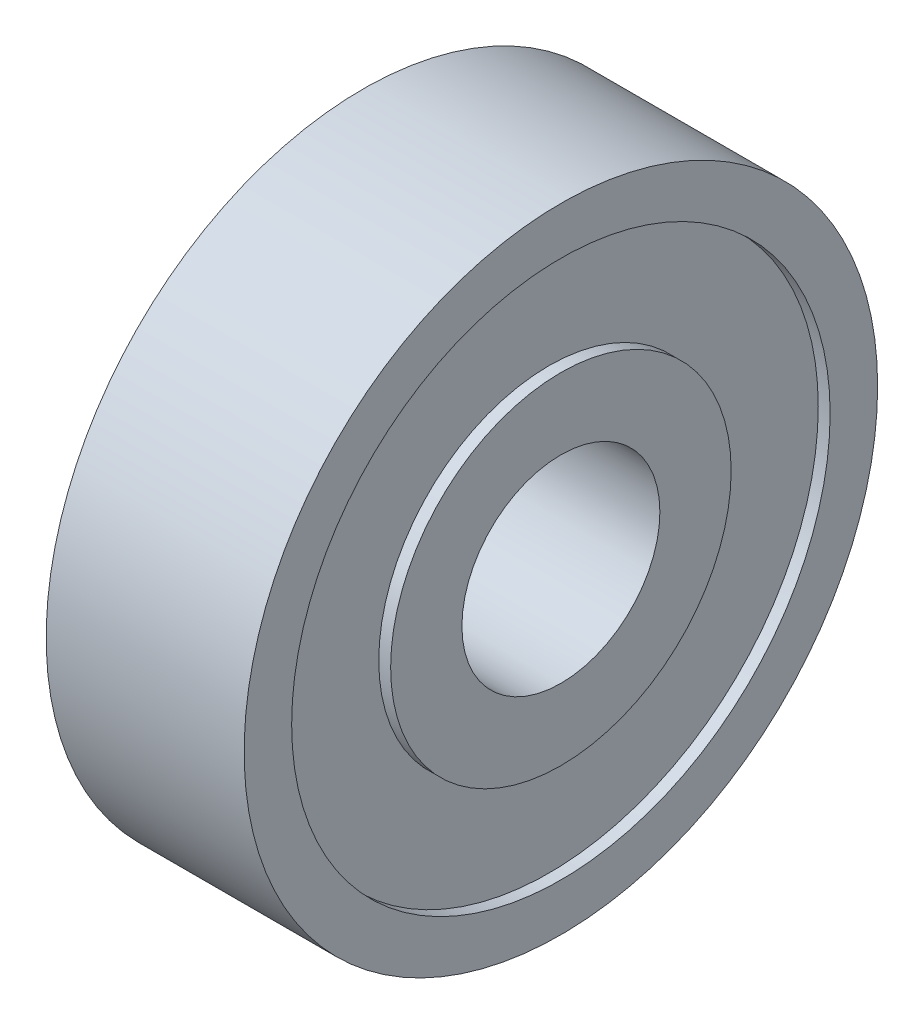
ISO-10303-21;
HEADER;
FILE_DESCRIPTION(('STEP AP214'),'2;1');
FILE_NAME('part.step','',(''),(''),'','','');
FILE_SCHEMA(('AUTOMOTIVE_DESIGN { 1 0 10303 214 1 1 1 1 }'));
ENDSEC;
DATA;
#1=APPLICATION_CONTEXT('core data for automotive mechanical design processes');
#2=APPLICATION_PROTOCOL_DEFINITION('international standard','automotive_design',2000,#1);
#3=PRODUCT_CONTEXT('',#1,'mechanical');
#4=PRODUCT('Part','Part','',(#3));
#5=PRODUCT_RELATED_PRODUCT_CATEGORY('part','',(#4));
#6=PRODUCT_DEFINITION_FORMATION('','',#4);
#7=PRODUCT_DEFINITION_CONTEXT('part definition',#1,'design');
#8=PRODUCT_DEFINITION('design','',#6,#7);
#9=PRODUCT_DEFINITION_SHAPE('','',#8);
#10=(LENGTH_UNIT() NAMED_UNIT(*) SI_UNIT(.MILLI.,.METRE.));
#11=(NAMED_UNIT(*) PLANE_ANGLE_UNIT() SI_UNIT($,.RADIAN.));
#12=(NAMED_UNIT(*) SI_UNIT($,.STERADIAN.) SOLID_ANGLE_UNIT());
#13=UNCERTAINTY_MEASURE_WITH_UNIT(LENGTH_MEASURE(1.E-05),#10,'distance_accuracy_value','');
#14=(GEOMETRIC_REPRESENTATION_CONTEXT(3) GLOBAL_UNCERTAINTY_ASSIGNED_CONTEXT((#13)) GLOBAL_UNIT_ASSIGNED_CONTEXT((#10,
#11,#12)) REPRESENTATION_CONTEXT('',''));
#15=CARTESIAN_POINT('',(0.,0.,0.));
#16=DIRECTION('',(0.,0.,1.));
#17=DIRECTION('',(1.,0.,0.));
#18=AXIS2_PLACEMENT_3D('',#15,#16,#17);
#19=CARTESIAN_POINT('',(-2.5,2.5,0.));
#20=DIRECTION('',(-1.,0.,0.));
#21=DIRECTION('',(0.,0.,1.));
#22=AXIS2_PLACEMENT_3D('',#19,#20,#21);
#23=PLANE('',#22);
#24=CARTESIAN_POINT('',(-2.5,0.,0.));
#25=DIRECTION('',(1.,0.,0.));
#26=DIRECTION('',(0.,0.,-1.));
#27=AXIS2_PLACEMENT_3D('',#24,#25,#26);
#28=CIRCLE('',#27,2.5);
#29=CARTESIAN_POINT('',(-2.5,0.,-2.5));
#30=VERTEX_POINT('',#29);
#31=EDGE_CURVE('E80',#30,#30,#28,.T.);
#32=ORIENTED_EDGE('',*,*,#31,.T.);
#33=EDGE_LOOP('',(#32));
#34=FACE_BOUND('',#33,.T.);
#35=CARTESIAN_POINT('',(-2.5,0.,0.));
#36=DIRECTION('',(1.,0.,0.));
#37=DIRECTION('',(0.,0.,-1.));
#38=AXIS2_PLACEMENT_3D('',#35,#36,#37);
#39=CIRCLE('',#38,4.3);
#40=CARTESIAN_POINT('',(-2.5,0.,-4.3));
#41=VERTEX_POINT('',#40);
#42=EDGE_CURVE('E10',#41,#41,#39,.T.);
#43=ORIENTED_EDGE('',*,*,#42,.F.);
#44=EDGE_LOOP('',(#43));
#45=FACE_BOUND('',#44,.T.);
#46=ADVANCED_FACE('F36',(#34,#45),#23,.T.);
#47=CARTESIAN_POINT('',(0.,0.,0.));
#48=DIRECTION('',(1.,0.,0.));
#49=DIRECTION('',(0.,0.,-1.));
#50=AXIS2_PLACEMENT_3D('',#47,#48,#49);
#51=CYLINDRICAL_SURFACE('',#50,4.3);
#52=ORIENTED_EDGE('',*,*,#42,.T.);
#53=EDGE_LOOP('',(#52));
#54=FACE_BOUND('',#53,.T.);
#55=CARTESIAN_POINT('',(-2.2,0.,0.));
#56=DIRECTION('',(1.,0.,0.));
#57=DIRECTION('',(0.,0.,-1.));
#58=AXIS2_PLACEMENT_3D('',#55,#56,#57);
#59=CIRCLE('',#58,4.3);
#60=CARTESIAN_POINT('',(-2.2,0.,-4.3));
#61=VERTEX_POINT('',#60);
#62=EDGE_CURVE('E42',#61,#61,#59,.T.);
#63=ORIENTED_EDGE('',*,*,#62,.F.);
#64=EDGE_LOOP('',(#63));
#65=FACE_BOUND('',#64,.T.);
#66=ADVANCED_FACE('F100',(#54,#65),#51,.T.);
#67=CARTESIAN_POINT('',(-2.2,4.3,0.));
#68=DIRECTION('',(-1.,0.,0.));
#69=DIRECTION('',(0.,0.,1.));
#70=AXIS2_PLACEMENT_3D('',#67,#68,#69);
#71=PLANE('',#70);
#72=ORIENTED_EDGE('',*,*,#62,.T.);
#73=EDGE_LOOP('',(#72));
#74=FACE_BOUND('',#73,.T.);
#75=CARTESIAN_POINT('',(-2.2,0.,0.));
#76=DIRECTION('',(1.,0.,0.));
#77=DIRECTION('',(0.,0.,-1.));
#78=AXIS2_PLACEMENT_3D('',#75,#76,#77);
#79=CIRCLE('',#78,6.8);
#80=CARTESIAN_POINT('',(-2.2,0.,-6.8));
#81=VERTEX_POINT('',#80);
#82=EDGE_CURVE('E46',#81,#81,#79,.T.);
#83=ORIENTED_EDGE('',*,*,#82,.F.);
#84=EDGE_LOOP('',(#83));
#85=FACE_BOUND('',#84,.T.);
#86=ADVANCED_FACE('F104',(#74,#85),#71,.T.);
#87=CARTESIAN_POINT('',(0.,0.,0.));
#88=DIRECTION('',(1.,0.,0.));
#89=DIRECTION('',(0.,0.,-1.));
#90=AXIS2_PLACEMENT_3D('',#87,#88,#89);
#91=CYLINDRICAL_SURFACE('',#90,6.8);
#92=ORIENTED_EDGE('',*,*,#82,.T.);
#93=EDGE_LOOP('',(#92));
#94=FACE_BOUND('',#93,.T.);
#95=CARTESIAN_POINT('',(-2.5,0.,0.));
#96=DIRECTION('',(1.,0.,0.));
#97=DIRECTION('',(0.,0.,-1.));
#98=AXIS2_PLACEMENT_3D('',#95,#96,#97);
#99=CIRCLE('',#98,6.8);
#100=CARTESIAN_POINT('',(-2.5,0.,-6.8));
#101=VERTEX_POINT('',#100);
#102=EDGE_CURVE('E51',#101,#101,#99,.T.);
#103=ORIENTED_EDGE('',*,*,#102,.F.);
#104=EDGE_LOOP('',(#103));
#105=FACE_BOUND('',#104,.T.);
#106=ADVANCED_FACE('F108',(#94,#105),#91,.F.);
#107=CARTESIAN_POINT('',(-2.5,6.8,0.));
#108=DIRECTION('',(-1.,0.,0.));
#109=DIRECTION('',(0.,0.,1.));
#110=AXIS2_PLACEMENT_3D('',#107,#108,#109);
#111=PLANE('',#110);
#112=ORIENTED_EDGE('',*,*,#102,.T.);
#113=EDGE_LOOP('',(#112));
#114=FACE_BOUND('',#113,.T.);
#115=CARTESIAN_POINT('',(-2.5,0.,0.));
#116=DIRECTION('',(1.,0.,0.));
#117=DIRECTION('',(0.,0.,-1.));
#118=AXIS2_PLACEMENT_3D('',#115,#116,#117);
#119=CIRCLE('',#118,8.);
#120=CARTESIAN_POINT('',(-2.5,0.,-8.));
#121=VERTEX_POINT('',#120);
#122=EDGE_CURVE('E57',#121,#121,#119,.T.);
#123=ORIENTED_EDGE('',*,*,#122,.F.);
#124=EDGE_LOOP('',(#123));
#125=FACE_BOUND('',#124,.T.);
#126=ADVANCED_FACE('F114',(#114,#125),#111,.T.);
#127=CARTESIAN_POINT('',(0.,0.,0.));
#128=DIRECTION('',(1.,0.,0.));
#129=DIRECTION('',(0.,0.,-1.));
#130=AXIS2_PLACEMENT_3D('',#127,#128,#129);
#131=CYLINDRICAL_SURFACE('',#130,8.);
#132=ORIENTED_EDGE('',*,*,#122,.T.);
#133=EDGE_LOOP('',(#132));
#134=FACE_BOUND('',#133,.T.);
#135=CARTESIAN_POINT('',(2.5,0.,0.));
#136=DIRECTION('',(1.,0.,0.));
#137=DIRECTION('',(0.,0.,-1.));
#138=AXIS2_PLACEMENT_3D('',#135,#136,#137);
#139=CIRCLE('',#138,8.);
#140=CARTESIAN_POINT('',(2.5,0.,-8.));
#141=VERTEX_POINT('',#140);
#142=EDGE_CURVE('E61',#141,#141,#139,.T.);
#143=ORIENTED_EDGE('',*,*,#142,.F.);
#144=EDGE_LOOP('',(#143));
#145=FACE_BOUND('',#144,.T.);
#146=ADVANCED_FACE('F118',(#134,#145),#131,.T.);
#147=CARTESIAN_POINT('',(2.5,6.8,0.));
#148=DIRECTION('',(1.,0.,0.));
#149=DIRECTION('',(0.,0.,-1.));
#150=AXIS2_PLACEMENT_3D('',#147,#148,#149);
#151=PLANE('',#150);
#152=ORIENTED_EDGE('',*,*,#142,.T.);
#153=EDGE_LOOP('',(#152));
#154=FACE_BOUND('',#153,.T.);
#155=CARTESIAN_POINT('',(2.5,0.,0.));
#156=DIRECTION('',(1.,0.,0.));
#157=DIRECTION('',(0.,0.,-1.));
#158=AXIS2_PLACEMENT_3D('',#155,#156,#157);
#159=CIRCLE('',#158,6.8);
#160=CARTESIAN_POINT('',(2.5,0.,-6.8));
#161=VERTEX_POINT('',#160);
#162=EDGE_CURVE('E64',#161,#161,#159,.T.);
#163=ORIENTED_EDGE('',*,*,#162,.F.);
#164=EDGE_LOOP('',(#163));
#165=FACE_BOUND('',#164,.T.);
#166=ADVANCED_FACE('F122',(#154,#165),#151,.T.);
#167=CARTESIAN_POINT('',(0.,0.,0.));
#168=DIRECTION('',(1.,0.,0.));
#169=DIRECTION('',(0.,0.,-1.));
#170=AXIS2_PLACEMENT_3D('',#167,#168,#169);
#171=CYLINDRICAL_SURFACE('',#170,6.8);
#172=ORIENTED_EDGE('',*,*,#162,.T.);
#173=EDGE_LOOP('',(#172));
#174=FACE_BOUND('',#173,.T.);
#175=CARTESIAN_POINT('',(2.2,0.,0.));
#176=DIRECTION('',(1.,0.,0.));
#177=DIRECTION('',(0.,0.,-1.));
#178=AXIS2_PLACEMENT_3D('',#175,#176,#177);
#179=CIRCLE('',#178,6.8);
#180=CARTESIAN_POINT('',(2.2,0.,-6.8));
#181=VERTEX_POINT('',#180);
#182=EDGE_CURVE('E67',#181,#181,#179,.T.);
#183=ORIENTED_EDGE('',*,*,#182,.F.);
#184=EDGE_LOOP('',(#183));
#185=FACE_BOUND('',#184,.T.);
#186=ADVANCED_FACE('F126',(#174,#185),#171,.F.);
#187=CARTESIAN_POINT('',(2.2,4.3,0.));
#188=DIRECTION('',(1.,0.,0.));
#189=DIRECTION('',(0.,0.,-1.));
#190=AXIS2_PLACEMENT_3D('',#187,#188,#189);
#191=PLANE('',#190);
#192=ORIENTED_EDGE('',*,*,#182,.T.);
#193=EDGE_LOOP('',(#192));
#194=FACE_BOUND('',#193,.T.);
#195=CARTESIAN_POINT('',(2.2,0.,0.));
#196=DIRECTION('',(1.,0.,0.));
#197=DIRECTION('',(0.,0.,-1.));
#198=AXIS2_PLACEMENT_3D('',#195,#196,#197);
#199=CIRCLE('',#198,4.3);
#200=CARTESIAN_POINT('',(2.2,0.,-4.3));
#201=VERTEX_POINT('',#200);
#202=EDGE_CURVE('E70',#201,#201,#199,.T.);
#203=ORIENTED_EDGE('',*,*,#202,.F.);
#204=EDGE_LOOP('',(#203));
#205=FACE_BOUND('',#204,.T.);
#206=ADVANCED_FACE('F130',(#194,#205),#191,.T.);
#207=CARTESIAN_POINT('',(0.,0.,0.));
#208=DIRECTION('',(1.,0.,0.));
#209=DIRECTION('',(0.,0.,-1.));
#210=AXIS2_PLACEMENT_3D('',#207,#208,#209);
#211=CYLINDRICAL_SURFACE('',#210,4.3);
#212=ORIENTED_EDGE('',*,*,#202,.T.);
#213=EDGE_LOOP('',(#212));
#214=FACE_BOUND('',#213,.T.);
#215=CARTESIAN_POINT('',(2.5,0.,0.));
#216=DIRECTION('',(1.,0.,0.));
#217=DIRECTION('',(0.,0.,-1.));
#218=AXIS2_PLACEMENT_3D('',#215,#216,#217);
#219=CIRCLE('',#218,4.3);
#220=CARTESIAN_POINT('',(2.5,0.,-4.3));
#221=VERTEX_POINT('',#220);
#222=EDGE_CURVE('E73',#221,#221,#219,.T.);
#223=ORIENTED_EDGE('',*,*,#222,.F.);
#224=EDGE_LOOP('',(#223));
#225=FACE_BOUND('',#224,.T.);
#226=ADVANCED_FACE('F96',(#214,#225),#211,.T.);
#227=CARTESIAN_POINT('',(2.5,2.5,0.));
#228=DIRECTION('',(1.,0.,0.));
#229=DIRECTION('',(0.,0.,-1.));
#230=AXIS2_PLACEMENT_3D('',#227,#228,#229);
#231=PLANE('',#230);
#232=ORIENTED_EDGE('',*,*,#222,.T.);
#233=EDGE_LOOP('',(#232));
#234=FACE_BOUND('',#233,.T.);
#235=CARTESIAN_POINT('',(2.5,0.,0.));
#236=DIRECTION('',(1.,0.,0.));
#237=DIRECTION('',(0.,0.,-1.));
#238=AXIS2_PLACEMENT_3D('',#235,#236,#237);
#239=CIRCLE('',#238,2.5);
#240=CARTESIAN_POINT('',(2.5,0.,-2.5));
#241=VERTEX_POINT('',#240);
#242=EDGE_CURVE('E77',#241,#241,#239,.T.);
#243=ORIENTED_EDGE('',*,*,#242,.F.);
#244=EDGE_LOOP('',(#243));
#245=FACE_BOUND('',#244,.T.);
#246=ADVANCED_FACE('F90',(#234,#245),#231,.T.);
#247=CARTESIAN_POINT('',(0.,0.,0.));
#248=DIRECTION('',(1.,0.,0.));
#249=DIRECTION('',(0.,0.,-1.));
#250=AXIS2_PLACEMENT_3D('',#247,#248,#249);
#251=CYLINDRICAL_SURFACE('',#250,2.5);
#252=ORIENTED_EDGE('',*,*,#242,.T.);
#253=EDGE_LOOP('',(#252));
#254=FACE_BOUND('',#253,.T.);
#255=ORIENTED_EDGE('',*,*,#31,.F.);
#256=EDGE_LOOP('',(#255));
#257=FACE_BOUND('',#256,.T.);
#258=ADVANCED_FACE('F88',(#254,#257),#251,.F.);
#259=CLOSED_SHELL('',(#46,#66,#86,#106,#126,#146,#166,#186,#206,#226,#246,#258));
#260=MANIFOLD_SOLID_BREP('B2',#259);
#261=ADVANCED_BREP_SHAPE_REPRESENTATION('',(#18,#260),#14);
#262=SHAPE_DEFINITION_REPRESENTATION(#9,#261);
ENDSEC;
END-ISO-10303-21;
